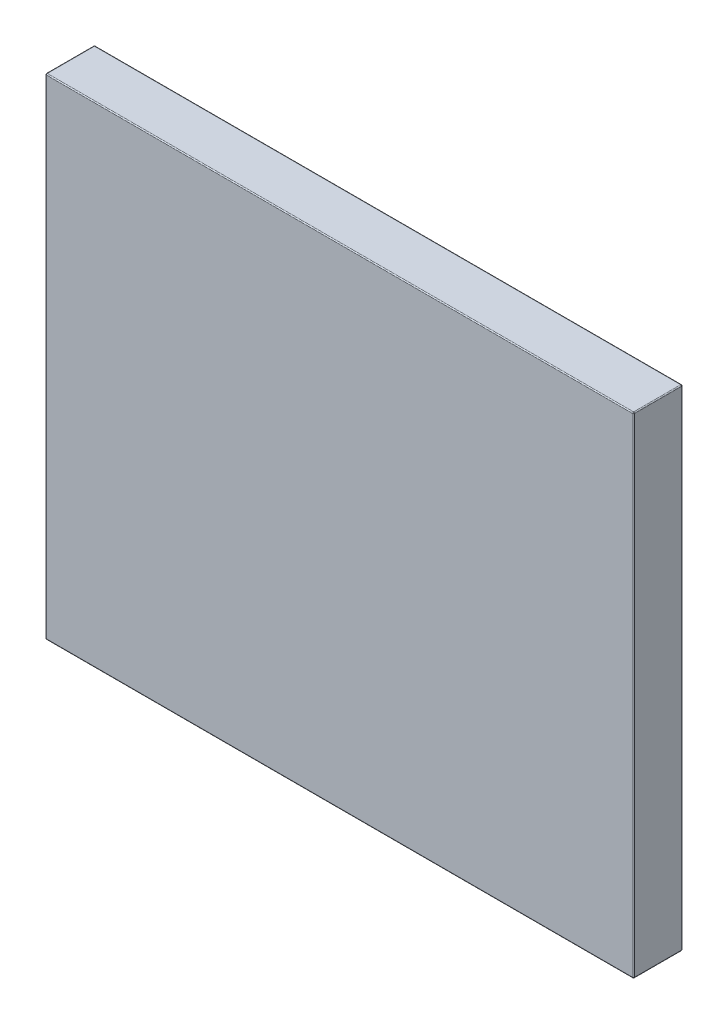
ISO-10303-21;
HEADER;
FILE_DESCRIPTION(('STEP AP214'),'2;1');
FILE_NAME('part.step','',(''),(''),'','','');
FILE_SCHEMA(('AUTOMOTIVE_DESIGN { 1 0 10303 214 1 1 1 1 }'));
ENDSEC;
DATA;
#1=APPLICATION_CONTEXT('core data for automotive mechanical design processes');
#2=APPLICATION_PROTOCOL_DEFINITION('international standard','automotive_design',2000,#1);
#3=PRODUCT_CONTEXT('',#1,'mechanical');
#4=PRODUCT('Part','Part','',(#3));
#5=PRODUCT_RELATED_PRODUCT_CATEGORY('part','',(#4));
#6=PRODUCT_DEFINITION_FORMATION('','',#4);
#7=PRODUCT_DEFINITION_CONTEXT('part definition',#1,'design');
#8=PRODUCT_DEFINITION('design','',#6,#7);
#9=PRODUCT_DEFINITION_SHAPE('','',#8);
#10=(LENGTH_UNIT() NAMED_UNIT(*) SI_UNIT(.MILLI.,.METRE.));
#11=(NAMED_UNIT(*) PLANE_ANGLE_UNIT() SI_UNIT($,.RADIAN.));
#12=(NAMED_UNIT(*) SI_UNIT($,.STERADIAN.) SOLID_ANGLE_UNIT());
#13=UNCERTAINTY_MEASURE_WITH_UNIT(LENGTH_MEASURE(1.E-05),#10,'distance_accuracy_value','');
#14=(GEOMETRIC_REPRESENTATION_CONTEXT(3) GLOBAL_UNCERTAINTY_ASSIGNED_CONTEXT((#13)) GLOBAL_UNIT_ASSIGNED_CONTEXT((#10,
#11,#12)) REPRESENTATION_CONTEXT('',''));
#15=CARTESIAN_POINT('',(0.,0.,0.));
#16=DIRECTION('',(0.,0.,1.));
#17=DIRECTION('',(1.,0.,0.));
#18=AXIS2_PLACEMENT_3D('',#15,#16,#17);
#19=CARTESIAN_POINT('',(0.299000000000127,-0.248999999999999,0.0490000000000004));
#20=DIRECTION('',(-0.816496580927742,-0.408248290463871,0.408248290463863));
#21=DIRECTION('',(0.577350269189626,-0.577350269189651,0.577350269189642));
#22=AXIS2_PLACEMENT_3D('',#19,#20,#21);
#23=SPHERICAL_SURFACE('',#22,0.001);
#24=CARTESIAN_POINT('',(0.299000000000127,-0.248999999999999,0.0490000000000004));
#25=DIRECTION('',(1.00000000000003,0.,0.));
#26=DIRECTION('',(0.,-1.00000000000003,0.));
#27=AXIS2_PLACEMENT_3D('',#24,#25,#26);
#28=CIRCLE('',#27,0.001);
#29=CARTESIAN_POINT('',(0.299000000000127,-0.248999999999999,0.0500000000000014));
#30=VERTEX_POINT('',#29);
#31=CARTESIAN_POINT('',(0.299000000000127,-0.25,0.0490000000000004));
#32=VERTEX_POINT('',#31);
#33=EDGE_CURVE('E11',#30,#32,#28,.T.);
#34=ORIENTED_EDGE('',*,*,#33,.T.);
#35=CARTESIAN_POINT('',(0.299000000000127,-0.248999999999999,0.0490000000000004));
#36=DIRECTION('',(0.,0.,1.));
#37=DIRECTION('',(1.00000000000003,0.,0.));
#38=AXIS2_PLACEMENT_3D('',#35,#36,#37);
#39=CIRCLE('',#38,0.001);
#40=CARTESIAN_POINT('',(0.300000000000128,-0.249000000000013,0.0490000000000004));
#41=VERTEX_POINT('',#40);
#42=EDGE_CURVE('E27',#32,#41,#39,.T.);
#43=ORIENTED_EDGE('',*,*,#42,.T.);
#44=CARTESIAN_POINT('',(0.299000000000127,-0.248999999999999,0.0490000000000004));
#45=DIRECTION('',(0.,-1.00000000000003,0.));
#46=DIRECTION('',(0.,0.,1.));
#47=AXIS2_PLACEMENT_3D('',#44,#45,#46);
#48=CIRCLE('',#47,0.001);
#49=EDGE_CURVE('E190',#41,#30,#48,.T.);
#50=ORIENTED_EDGE('',*,*,#49,.T.);
#51=EDGE_LOOP('',(#34,#43,#50));
#52=FACE_BOUND('',#51,.T.);
#53=ADVANCED_FACE('F16',(#52),#23,.T.);
#54=CARTESIAN_POINT('',(-0.298999999999872,-0.249000000001026,0.0490000000000004));
#55=DIRECTION('',(-0.816496580927742,0.408248290463875,-0.408248290463863));
#56=DIRECTION('',(-0.577350269189642,-0.577350269189642,0.577350269189626));
#57=AXIS2_PLACEMENT_3D('',#54,#55,#56);
#58=SPHERICAL_SURFACE('',#57,0.001);
#59=CARTESIAN_POINT('',(-0.298999999999872,-0.249000000001026,0.0490000000000004));
#60=DIRECTION('',(0.,-1.00000000000003,0.));
#61=DIRECTION('',(-1.00000000000003,0.,0.));
#62=AXIS2_PLACEMENT_3D('',#59,#60,#61);
#63=CIRCLE('',#62,0.001);
#64=CARTESIAN_POINT('',(-0.298999999999872,-0.249000000001026,0.0500000000000014));
#65=VERTEX_POINT('',#64);
#66=CARTESIAN_POINT('',(-0.299999999999872,-0.249000000002053,0.0490000000000004));
#67=VERTEX_POINT('',#66);
#68=EDGE_CURVE('E314',#65,#67,#63,.T.);
#69=ORIENTED_EDGE('',*,*,#68,.T.);
#70=CARTESIAN_POINT('',(-0.298999999999872,-0.249000000001026,0.0490000000000004));
#71=DIRECTION('',(0.,0.,1.));
#72=DIRECTION('',(0.,-1.00000000000003,0.));
#73=AXIS2_PLACEMENT_3D('',#70,#71,#72);
#74=CIRCLE('',#73,0.001);
#75=CARTESIAN_POINT('',(-0.298999999999872,-0.250000000001027,0.0490000000000004));
#76=VERTEX_POINT('',#75);
#77=EDGE_CURVE('E199',#67,#76,#74,.T.);
#78=ORIENTED_EDGE('',*,*,#77,.T.);
#79=CARTESIAN_POINT('',(-0.298999999999872,-0.249000000001026,0.0490000000000004));
#80=DIRECTION('',(-1.00000000000003,0.,0.));
#81=DIRECTION('',(0.,0.,1.));
#82=AXIS2_PLACEMENT_3D('',#79,#80,#81);
#83=CIRCLE('',#82,0.001);
#84=EDGE_CURVE('E195',#76,#65,#83,.T.);
#85=ORIENTED_EDGE('',*,*,#84,.T.);
#86=EDGE_LOOP('',(#69,#78,#85));
#87=FACE_BOUND('',#86,.T.);
#88=ADVANCED_FACE('F313',(#87),#58,.T.);
#89=CARTESIAN_POINT('',(0.299000000000127,-0.248999999999999,0.001000000000001));
#90=DIRECTION('',(-0.816496580927742,-0.408248290463867,-0.408248290463863));
#91=DIRECTION('',(0.577350269189626,-0.577350269189642,-0.57735026918961));
#92=AXIS2_PLACEMENT_3D('',#89,#90,#91);
#93=SPHERICAL_SURFACE('',#92,0.001);
#94=CARTESIAN_POINT('',(0.299000000000127,-0.248999999999999,0.001000000000001));
#95=DIRECTION('',(1.00000000000003,0.,0.));
#96=DIRECTION('',(0.,0.,-1.));
#97=AXIS2_PLACEMENT_3D('',#94,#95,#96);
#98=CIRCLE('',#97,0.001);
#99=CARTESIAN_POINT('',(0.299000000000126,-0.25,0.001000000000001));
#100=VERTEX_POINT('',#99);
#101=CARTESIAN_POINT('',(0.299000000000127,-0.248999999999999,0.));
#102=VERTEX_POINT('',#101);
#103=EDGE_CURVE('E200',#100,#102,#98,.T.);
#104=ORIENTED_EDGE('',*,*,#103,.T.);
#105=CARTESIAN_POINT('',(0.299000000000127,-0.248999999999999,0.001000000000001));
#106=DIRECTION('',(0.,-1.00000000000003,0.));
#107=DIRECTION('',(1.00000000000003,0.,0.));
#108=AXIS2_PLACEMENT_3D('',#105,#106,#107);
#109=CIRCLE('',#108,0.001);
#110=CARTESIAN_POINT('',(0.300000000000128,-0.249000000000013,0.001000000000001));
#111=VERTEX_POINT('',#110);
#112=EDGE_CURVE('E217',#102,#111,#109,.T.);
#113=ORIENTED_EDGE('',*,*,#112,.T.);
#114=CARTESIAN_POINT('',(0.299000000000127,-0.248999999999999,0.001000000000001));
#115=DIRECTION('',(0.,0.,-1.));
#116=DIRECTION('',(0.,-1.00000000000003,0.));
#117=AXIS2_PLACEMENT_3D('',#114,#115,#116);
#118=CIRCLE('',#117,0.001);
#119=EDGE_CURVE('E207',#111,#100,#118,.T.);
#120=ORIENTED_EDGE('',*,*,#119,.T.);
#121=EDGE_LOOP('',(#104,#113,#120));
#122=FACE_BOUND('',#121,.T.);
#123=ADVANCED_FACE('F341',(#122),#93,.T.);
#124=CARTESIAN_POINT('',(0.299000000000001,0.248999999999999,0.0490000000000004));
#125=DIRECTION('',(0.408248290463871,0.408248290463875,-0.816496580927726));
#126=DIRECTION('',(0.577350269189642,0.577350269189626,0.577350269189626));
#127=AXIS2_PLACEMENT_3D('',#124,#125,#126);
#128=SPHERICAL_SURFACE('',#127,0.001);
#129=CARTESIAN_POINT('',(0.299000000000001,0.248999999999999,0.0490000000000004));
#130=DIRECTION('',(0.,1.00000000000003,0.));
#131=DIRECTION('',(1.00000000000003,0.,0.));
#132=AXIS2_PLACEMENT_3D('',#129,#130,#131);
#133=CIRCLE('',#132,0.001);
#134=CARTESIAN_POINT('',(0.299000000000001,0.248999999999999,0.0500000000000014));
#135=VERTEX_POINT('',#134);
#136=CARTESIAN_POINT('',(0.3,0.248999999999999,0.0490000000000004));
#137=VERTEX_POINT('',#136);
#138=EDGE_CURVE('E205',#135,#137,#133,.T.);
#139=ORIENTED_EDGE('',*,*,#138,.T.);
#140=CARTESIAN_POINT('',(0.299000000000001,0.248999999999999,0.0490000000000004));
#141=DIRECTION('',(0.,0.,1.));
#142=DIRECTION('',(0.,1.00000000000003,0.));
#143=AXIS2_PLACEMENT_3D('',#140,#141,#142);
#144=CIRCLE('',#143,0.001);
#145=CARTESIAN_POINT('',(0.299000000000001,0.25,0.0490000000000004));
#146=VERTEX_POINT('',#145);
#147=EDGE_CURVE('E138',#137,#146,#144,.T.);
#148=ORIENTED_EDGE('',*,*,#147,.T.);
#149=CARTESIAN_POINT('',(0.299000000000001,0.248999999999999,0.0490000000000004));
#150=DIRECTION('',(1.00000000000003,0.,0.));
#151=DIRECTION('',(0.,0.,1.));
#152=AXIS2_PLACEMENT_3D('',#149,#150,#151);
#153=CIRCLE('',#152,0.001);
#154=EDGE_CURVE('E219',#146,#135,#153,.T.);
#155=ORIENTED_EDGE('',*,*,#154,.T.);
#156=EDGE_LOOP('',(#139,#148,#155));
#157=FACE_BOUND('',#156,.T.);
#158=ADVANCED_FACE('F362',(#157),#128,.T.);
#159=CARTESIAN_POINT('',(-0.299000000000127,0.248999999998972,0.0490000000000004));
#160=DIRECTION('',(-0.408248290463875,-0.816496580927742,0.408248290463863));
#161=DIRECTION('',(-0.577350269189626,0.577350269189642,0.57735026918961));
#162=AXIS2_PLACEMENT_3D('',#159,#160,#161);
#163=SPHERICAL_SURFACE('',#162,0.001);
#164=CARTESIAN_POINT('',(-0.299000000000127,0.248999999998972,0.0490000000000004));
#165=DIRECTION('',(-1.00000000000003,0.,0.));
#166=DIRECTION('',(0.,1.00000000000003,0.));
#167=AXIS2_PLACEMENT_3D('',#164,#165,#166);
#168=CIRCLE('',#167,0.001);
#169=CARTESIAN_POINT('',(-0.299000000000127,0.248999999998972,0.0500000000000014));
#170=VERTEX_POINT('',#169);
#171=CARTESIAN_POINT('',(-0.298999999999999,0.249999999998973,0.0490000000000004));
#172=VERTEX_POINT('',#171);
#173=EDGE_CURVE('E225',#170,#172,#168,.T.);
#174=ORIENTED_EDGE('',*,*,#173,.T.);
#175=CARTESIAN_POINT('',(-0.299000000000127,0.248999999998972,0.0490000000000004));
#176=DIRECTION('',(0.,0.,1.));
#177=DIRECTION('',(-1.00000000000003,0.,0.));
#178=AXIS2_PLACEMENT_3D('',#175,#176,#177);
#179=CIRCLE('',#178,0.001);
#180=CARTESIAN_POINT('',(-0.300000000000128,0.248999999997959,0.0490000000000004));
#181=VERTEX_POINT('',#180);
#182=EDGE_CURVE('E240',#172,#181,#179,.T.);
#183=ORIENTED_EDGE('',*,*,#182,.T.);
#184=CARTESIAN_POINT('',(-0.299000000000127,0.248999999998972,0.0490000000000004));
#185=DIRECTION('',(0.,1.00000000000003,0.));
#186=DIRECTION('',(0.,0.,1.));
#187=AXIS2_PLACEMENT_3D('',#184,#185,#186);
#188=CIRCLE('',#187,0.001);
#189=EDGE_CURVE('E244',#181,#170,#188,.T.);
#190=ORIENTED_EDGE('',*,*,#189,.T.);
#191=EDGE_LOOP('',(#174,#183,#190));
#192=FACE_BOUND('',#191,.T.);
#193=ADVANCED_FACE('F358',(#192),#163,.T.);
#194=CARTESIAN_POINT('',(-0.298999999999872,-0.249000000001026,0.001000000000001));
#195=DIRECTION('',(0.408248290463871,0.408248290463875,-0.816496580927726));
#196=DIRECTION('',(-0.577350269189642,-0.577350269189626,-0.577350269189626));
#197=AXIS2_PLACEMENT_3D('',#194,#195,#196);
#198=SPHERICAL_SURFACE('',#197,0.001);
#199=CARTESIAN_POINT('',(-0.298999999999872,-0.249000000001026,0.001000000000001));
#200=DIRECTION('',(0.,-1.00000000000003,0.));
#201=DIRECTION('',(0.,0.,-1.));
#202=AXIS2_PLACEMENT_3D('',#199,#200,#201);
#203=CIRCLE('',#202,0.001);
#204=CARTESIAN_POINT('',(-0.299999999999872,-0.249000000002053,0.001000000000001));
#205=VERTEX_POINT('',#204);
#206=CARTESIAN_POINT('',(-0.298999999999872,-0.249000000001026,0.));
#207=VERTEX_POINT('',#206);
#208=EDGE_CURVE('E253',#205,#207,#203,.T.);
#209=ORIENTED_EDGE('',*,*,#208,.T.);
#210=CARTESIAN_POINT('',(-0.298999999999872,-0.249000000001026,0.001000000000001));
#211=DIRECTION('',(-1.00000000000003,0.,0.));
#212=DIRECTION('',(0.,-1.00000000000003,0.));
#213=AXIS2_PLACEMENT_3D('',#210,#211,#212);
#214=CIRCLE('',#213,0.001);
#215=CARTESIAN_POINT('',(-0.298999999999872,-0.250000000001027,0.001000000000001));
#216=VERTEX_POINT('',#215);
#217=EDGE_CURVE('E256',#207,#216,#214,.T.);
#218=ORIENTED_EDGE('',*,*,#217,.T.);
#219=CARTESIAN_POINT('',(-0.298999999999872,-0.249000000001026,0.001000000000001));
#220=DIRECTION('',(0.,0.,-1.));
#221=DIRECTION('',(-1.00000000000003,0.,0.));
#222=AXIS2_PLACEMENT_3D('',#219,#220,#221);
#223=CIRCLE('',#222,0.001);
#224=EDGE_CURVE('E258',#216,#205,#223,.T.);
#225=ORIENTED_EDGE('',*,*,#224,.T.);
#226=EDGE_LOOP('',(#209,#218,#225));
#227=FACE_BOUND('',#226,.T.);
#228=ADVANCED_FACE('F361',(#227),#198,.T.);
#229=CARTESIAN_POINT('',(-0.149999999999872,-0.248999999999999,0.001000000000001));
#230=DIRECTION('',(-1.00000000000003,0.,0.));
#231=DIRECTION('',(0.,-0.707106781186564,-0.707106781186548));
#232=AXIS2_PLACEMENT_3D('',#229,#230,#231);
#233=CYLINDRICAL_SURFACE('',#232,0.001);
#234=ORIENTED_EDGE('',*,*,#217,.F.);
#235=DIRECTION('',(1.00000000000003,0.,0.));
#236=VECTOR('',#235,1.);
#237=CARTESIAN_POINT('',(-0.149999999999872,-0.248999999999999,0.));
#238=LINE('',#237,#236);
#239=EDGE_CURVE('E203',#207,#102,#238,.T.);
#240=ORIENTED_EDGE('',*,*,#239,.T.);
#241=ORIENTED_EDGE('',*,*,#103,.F.);
#242=DIRECTION('',(-1.00000000000003,0.,0.));
#243=VECTOR('',#242,1.);
#244=CARTESIAN_POINT('',(-0.149999999999872,-0.25,0.001000000000001));
#245=LINE('',#244,#243);
#246=EDGE_CURVE('E201',#100,#216,#245,.T.);
#247=ORIENTED_EDGE('',*,*,#246,.T.);
#248=EDGE_LOOP('',(#234,#240,#241,#247));
#249=FACE_BOUND('',#248,.T.);
#250=ADVANCED_FACE('F376',(#249),#233,.T.);
#251=CARTESIAN_POINT('',(-0.298999999999872,-0.249000000001026,0.));
#252=DIRECTION('',(0.,0.,1.));
#253=DIRECTION('',(-0.707106781186556,-0.707106781186564,0.));
#254=AXIS2_PLACEMENT_3D('',#251,#252,#253);
#255=CYLINDRICAL_SURFACE('',#254,0.001);
#256=ORIENTED_EDGE('',*,*,#77,.F.);
#257=DIRECTION('',(0.,0.,-1.));
#258=VECTOR('',#257,1.);
#259=CARTESIAN_POINT('',(-0.299999999999872,-0.249000000002053,0.));
#260=LINE('',#259,#258);
#261=EDGE_CURVE('E204',#67,#205,#260,.T.);
#262=ORIENTED_EDGE('',*,*,#261,.T.);
#263=ORIENTED_EDGE('',*,*,#224,.F.);
#264=DIRECTION('',(0.,0.,1.));
#265=VECTOR('',#264,1.);
#266=CARTESIAN_POINT('',(-0.298999999999872,-0.250000000001027,0.));
#267=LINE('',#266,#265);
#268=EDGE_CURVE('E166',#216,#76,#267,.T.);
#269=ORIENTED_EDGE('',*,*,#268,.T.);
#270=EDGE_LOOP('',(#256,#262,#263,#269));
#271=FACE_BOUND('',#270,.T.);
#272=ADVANCED_FACE('F304',(#271),#255,.T.);
#273=CARTESIAN_POINT('',(0.299000000000001,0.248999999999999,0.001000000000001));
#274=DIRECTION('',(-0.408248290463871,-0.408248290463867,-0.816496580927726));
#275=DIRECTION('',(0.577350269189642,0.577350269189642,-0.577350269189626));
#276=AXIS2_PLACEMENT_3D('',#273,#274,#275);
#277=SPHERICAL_SURFACE('',#276,0.001);
#278=CARTESIAN_POINT('',(0.299000000000001,0.248999999999999,0.001000000000001));
#279=DIRECTION('',(0.,1.00000000000003,0.));
#280=DIRECTION('',(0.,0.,-1.));
#281=AXIS2_PLACEMENT_3D('',#278,#279,#280);
#282=CIRCLE('',#281,0.001);
#283=CARTESIAN_POINT('',(0.3,0.248999999999999,0.001000000000001));
#284=VERTEX_POINT('',#283);
#285=CARTESIAN_POINT('',(0.299000000000001,0.248999999999999,0.));
#286=VERTEX_POINT('',#285);
#287=EDGE_CURVE('E150',#284,#286,#282,.T.);
#288=ORIENTED_EDGE('',*,*,#287,.T.);
#289=CARTESIAN_POINT('',(0.299000000000001,0.248999999999999,0.001000000000001));
#290=DIRECTION('',(1.00000000000003,0.,0.));
#291=DIRECTION('',(0.,1.00000000000003,0.));
#292=AXIS2_PLACEMENT_3D('',#289,#290,#291);
#293=CIRCLE('',#292,0.001);
#294=CARTESIAN_POINT('',(0.298999999999999,0.25,0.001000000000001));
#295=VERTEX_POINT('',#294);
#296=EDGE_CURVE('E153',#286,#295,#293,.T.);
#297=ORIENTED_EDGE('',*,*,#296,.T.);
#298=CARTESIAN_POINT('',(0.299000000000001,0.248999999999999,0.001000000000001));
#299=DIRECTION('',(0.,0.,-1.));
#300=DIRECTION('',(1.00000000000003,0.,0.));
#301=AXIS2_PLACEMENT_3D('',#298,#299,#300);
#302=CIRCLE('',#301,0.001);
#303=EDGE_CURVE('E135',#295,#284,#302,.T.);
#304=ORIENTED_EDGE('',*,*,#303,.T.);
#305=EDGE_LOOP('',(#288,#297,#304));
#306=FACE_BOUND('',#305,.T.);
#307=ADVANCED_FACE('F149',(#306),#277,.T.);
#308=CARTESIAN_POINT('',(-0.299000000000127,0.248999999998972,0.001000000000001));
#309=DIRECTION('',(-0.408248290463875,-0.816496580927759,-0.408248290463863));
#310=DIRECTION('',(-0.577350269189626,0.577350269189651,-0.577350269189642));
#311=AXIS2_PLACEMENT_3D('',#308,#309,#310);
#312=SPHERICAL_SURFACE('',#311,0.001);
#313=CARTESIAN_POINT('',(-0.299000000000127,0.248999999998972,0.001000000000001));
#314=DIRECTION('',(0.,0.,-1.));
#315=DIRECTION('',(0.,1.00000000000003,0.));
#316=AXIS2_PLACEMENT_3D('',#313,#314,#315);
#317=CIRCLE('',#316,0.001);
#318=CARTESIAN_POINT('',(-0.300000000000128,0.248999999997959,0.001000000000001));
#319=VERTEX_POINT('',#318);
#320=CARTESIAN_POINT('',(-0.298999999999999,0.249999999998973,0.001000000000001));
#321=VERTEX_POINT('',#320);
#322=EDGE_CURVE('E156',#319,#321,#317,.T.);
#323=ORIENTED_EDGE('',*,*,#322,.T.);
#324=CARTESIAN_POINT('',(-0.299000000000127,0.248999999998972,0.001000000000001));
#325=DIRECTION('',(-1.00000000000003,0.,0.));
#326=DIRECTION('',(0.,0.,-1.));
#327=AXIS2_PLACEMENT_3D('',#324,#325,#326);
#328=CIRCLE('',#327,0.001);
#329=CARTESIAN_POINT('',(-0.299000000000127,0.248999999998972,0.));
#330=VERTEX_POINT('',#329);
#331=EDGE_CURVE('E229',#321,#330,#328,.T.);
#332=ORIENTED_EDGE('',*,*,#331,.T.);
#333=CARTESIAN_POINT('',(-0.299000000000127,0.248999999998972,0.001000000000001));
#334=DIRECTION('',(0.,1.00000000000003,0.));
#335=DIRECTION('',(-1.00000000000003,0.,0.));
#336=AXIS2_PLACEMENT_3D('',#333,#334,#335);
#337=CIRCLE('',#336,0.001);
#338=EDGE_CURVE('E194',#330,#319,#337,.T.);
#339=ORIENTED_EDGE('',*,*,#338,.T.);
#340=EDGE_LOOP('',(#323,#332,#339));
#341=FACE_BOUND('',#340,.T.);
#342=ADVANCED_FACE('F351',(#341),#312,.T.);
#343=CARTESIAN_POINT('',(0.150000000000001,0.248999999997945,0.001000000000001));
#344=DIRECTION('',(1.00000000000003,0.,0.));
#345=DIRECTION('',(0.,0.707106781186564,-0.707106781186548));
#346=AXIS2_PLACEMENT_3D('',#343,#344,#345);
#347=CYLINDRICAL_SURFACE('',#346,0.001);
#348=ORIENTED_EDGE('',*,*,#296,.F.);
#349=DIRECTION('',(-1.00000000000003,0.,0.));
#350=VECTOR('',#349,1.);
#351=CARTESIAN_POINT('',(0.150000000000001,0.248999999997945,0.));
#352=LINE('',#351,#350);
#353=EDGE_CURVE('E191',#286,#330,#352,.T.);
#354=ORIENTED_EDGE('',*,*,#353,.T.);
#355=ORIENTED_EDGE('',*,*,#331,.F.);
#356=DIRECTION('',(1.00000000000003,0.,0.));
#357=VECTOR('',#356,1.);
#358=CARTESIAN_POINT('',(0.149999999999872,0.249999999997946,0.001000000000001));
#359=LINE('',#358,#357);
#360=EDGE_CURVE('E20',#321,#295,#359,.T.);
#361=ORIENTED_EDGE('',*,*,#360,.T.);
#362=EDGE_LOOP('',(#348,#354,#355,#361));
#363=FACE_BOUND('',#362,.T.);
#364=ADVANCED_FACE('F18',(#363),#347,.T.);
#365=CARTESIAN_POINT('',(-0.299000000000127,0.124999999998973,0.001000000000001));
#366=DIRECTION('',(0.,1.00000000000003,0.));
#367=DIRECTION('',(-0.707106781186564,0.,-0.707106781186548));
#368=AXIS2_PLACEMENT_3D('',#365,#366,#367);
#369=CYLINDRICAL_SURFACE('',#368,0.001);
#370=ORIENTED_EDGE('',*,*,#338,.F.);
#371=DIRECTION('',(0.,-1.00000000000003,0.));
#372=VECTOR('',#371,1.);
#373=CARTESIAN_POINT('',(-0.299000000000127,0.124999999998973,0.));
#374=LINE('',#373,#372);
#375=EDGE_CURVE('E248',#330,#207,#374,.T.);
#376=ORIENTED_EDGE('',*,*,#375,.T.);
#377=ORIENTED_EDGE('',*,*,#208,.F.);
#378=DIRECTION('',(0.,1.00000000000003,0.));
#379=VECTOR('',#378,1.);
#380=CARTESIAN_POINT('',(-0.300000000000128,0.124999999997946,0.001000000000001));
#381=LINE('',#380,#379);
#382=EDGE_CURVE('E251',#205,#319,#381,.T.);
#383=ORIENTED_EDGE('',*,*,#382,.T.);
#384=EDGE_LOOP('',(#370,#376,#377,#383));
#385=FACE_BOUND('',#384,.T.);
#386=ADVANCED_FACE('F366',(#385),#369,.T.);
#387=CARTESIAN_POINT('',(-0.299000000000127,0.248999999998972,0.));
#388=DIRECTION('',(0.,0.,1.));
#389=DIRECTION('',(-0.707106781186564,0.707106781186556,0.));
#390=AXIS2_PLACEMENT_3D('',#387,#388,#389);
#391=CYLINDRICAL_SURFACE('',#390,0.001);
#392=ORIENTED_EDGE('',*,*,#182,.F.);
#393=DIRECTION('',(0.,0.,-1.));
#394=VECTOR('',#393,1.);
#395=CARTESIAN_POINT('',(-0.298999999999999,0.249999999998973,0.));
#396=LINE('',#395,#394);
#397=EDGE_CURVE('E262',#172,#321,#396,.T.);
#398=ORIENTED_EDGE('',*,*,#397,.T.);
#399=ORIENTED_EDGE('',*,*,#322,.F.);
#400=DIRECTION('',(0.,0.,1.));
#401=VECTOR('',#400,1.);
#402=CARTESIAN_POINT('',(-0.300000000000128,0.248999999997959,0.));
#403=LINE('',#402,#401);
#404=EDGE_CURVE('E143',#319,#181,#403,.T.);
#405=ORIENTED_EDGE('',*,*,#404,.T.);
#406=EDGE_LOOP('',(#392,#398,#399,#405));
#407=FACE_BOUND('',#406,.T.);
#408=ADVANCED_FACE('F357',(#407),#391,.T.);
#409=CARTESIAN_POINT('',(0.299000000000001,0.248999999999999,0.));
#410=DIRECTION('',(0.,0.,1.));
#411=DIRECTION('',(0.707106781186556,0.707106781186564,0.));
#412=AXIS2_PLACEMENT_3D('',#409,#410,#411);
#413=CYLINDRICAL_SURFACE('',#412,0.001);
#414=ORIENTED_EDGE('',*,*,#147,.F.);
#415=DIRECTION('',(0.,0.,-1.));
#416=VECTOR('',#415,1.);
#417=CARTESIAN_POINT('',(0.3,0.248999999999999,0.));
#418=LINE('',#417,#416);
#419=EDGE_CURVE('E132',#137,#284,#418,.T.);
#420=ORIENTED_EDGE('',*,*,#419,.T.);
#421=ORIENTED_EDGE('',*,*,#303,.F.);
#422=DIRECTION('',(0.,0.,1.));
#423=VECTOR('',#422,1.);
#424=CARTESIAN_POINT('',(0.298999999999999,0.25,0.));
#425=LINE('',#424,#423);
#426=EDGE_CURVE('E144',#295,#146,#425,.T.);
#427=ORIENTED_EDGE('',*,*,#426,.T.);
#428=EDGE_LOOP('',(#414,#420,#421,#427));
#429=FACE_BOUND('',#428,.T.);
#430=ADVANCED_FACE('F134',(#429),#413,.T.);
#431=CARTESIAN_POINT('',(0.299000000000127,-0.125,0.001000000000001));
#432=DIRECTION('',(0.,-1.00000000000003,0.));
#433=DIRECTION('',(0.707106781186564,0.,-0.707106781186548));
#434=AXIS2_PLACEMENT_3D('',#431,#432,#433);
#435=CYLINDRICAL_SURFACE('',#434,0.001);
#436=ORIENTED_EDGE('',*,*,#112,.F.);
#437=DIRECTION('',(0.,1.00000000000003,0.));
#438=VECTOR('',#437,1.);
#439=CARTESIAN_POINT('',(0.299000000000127,-0.125,0.));
#440=LINE('',#439,#438);
#441=EDGE_CURVE('E164',#102,#286,#440,.T.);
#442=ORIENTED_EDGE('',*,*,#441,.T.);
#443=ORIENTED_EDGE('',*,*,#287,.F.);
#444=DIRECTION('',(0.,-1.00000000000003,0.));
#445=VECTOR('',#444,1.);
#446=CARTESIAN_POINT('',(0.300000000000128,-0.125,0.001000000000001));
#447=LINE('',#446,#445);
#448=EDGE_CURVE('E161',#284,#111,#447,.T.);
#449=ORIENTED_EDGE('',*,*,#448,.T.);
#450=EDGE_LOOP('',(#436,#442,#443,#449));
#451=FACE_BOUND('',#450,.T.);
#452=ADVANCED_FACE('F160',(#451),#435,.T.);
#453=CARTESIAN_POINT('',(-0.299000000000127,0.124999999998973,0.0490000000000004));
#454=DIRECTION('',(0.,-1.00000000000003,0.));
#455=DIRECTION('',(-0.707106781186564,0.,0.707106781186548));
#456=AXIS2_PLACEMENT_3D('',#453,#454,#455);
#457=CYLINDRICAL_SURFACE('',#456,0.001);
#458=ORIENTED_EDGE('',*,*,#68,.F.);
#459=DIRECTION('',(0.,1.00000000000003,0.));
#460=VECTOR('',#459,1.);
#461=CARTESIAN_POINT('',(-0.299000000000127,0.124999999998973,0.0500000000000014));
#462=LINE('',#461,#460);
#463=EDGE_CURVE('E173',#65,#170,#462,.T.);
#464=ORIENTED_EDGE('',*,*,#463,.T.);
#465=ORIENTED_EDGE('',*,*,#189,.F.);
#466=DIRECTION('',(0.,-1.00000000000003,0.));
#467=VECTOR('',#466,1.);
#468=CARTESIAN_POINT('',(-0.300000000000128,0.124999999997946,0.0490000000000004));
#469=LINE('',#468,#467);
#470=EDGE_CURVE('E181',#181,#67,#469,.T.);
#471=ORIENTED_EDGE('',*,*,#470,.T.);
#472=EDGE_LOOP('',(#458,#464,#465,#471));
#473=FACE_BOUND('',#472,.T.);
#474=ADVANCED_FACE('F345',(#473),#457,.T.);
#475=CARTESIAN_POINT('',(0.150000000000001,0.248999999997945,0.0490000000000004));
#476=DIRECTION('',(-1.00000000000003,0.,0.));
#477=DIRECTION('',(0.,0.707106781186564,0.707106781186548));
#478=AXIS2_PLACEMENT_3D('',#475,#476,#477);
#479=CYLINDRICAL_SURFACE('',#478,0.001);
#480=ORIENTED_EDGE('',*,*,#173,.F.);
#481=DIRECTION('',(1.00000000000003,0.,0.));
#482=VECTOR('',#481,1.);
#483=CARTESIAN_POINT('',(0.150000000000001,0.248999999997945,0.0500000000000014));
#484=LINE('',#483,#482);
#485=EDGE_CURVE('E273',#170,#135,#484,.T.);
#486=ORIENTED_EDGE('',*,*,#485,.T.);
#487=ORIENTED_EDGE('',*,*,#154,.F.);
#488=DIRECTION('',(-1.00000000000003,0.,0.));
#489=VECTOR('',#488,1.);
#490=CARTESIAN_POINT('',(0.150000000000001,0.249999999997946,0.0490000000000004));
#491=LINE('',#490,#489);
#492=EDGE_CURVE('E269',#146,#172,#491,.T.);
#493=ORIENTED_EDGE('',*,*,#492,.T.);
#494=EDGE_LOOP('',(#480,#486,#487,#493));
#495=FACE_BOUND('',#494,.T.);
#496=ADVANCED_FACE('F371',(#495),#479,.T.);
#497=CARTESIAN_POINT('',(0.299000000000127,-0.125,0.0490000000000004));
#498=DIRECTION('',(0.,1.00000000000003,0.));
#499=DIRECTION('',(0.707106781186564,0.,0.707106781186548));
#500=AXIS2_PLACEMENT_3D('',#497,#498,#499);
#501=CYLINDRICAL_SURFACE('',#500,0.001);
#502=ORIENTED_EDGE('',*,*,#138,.F.);
#503=DIRECTION('',(0.,-1.00000000000003,0.));
#504=VECTOR('',#503,1.);
#505=CARTESIAN_POINT('',(0.299000000000127,-0.125,0.0500000000000014));
#506=LINE('',#505,#504);
#507=EDGE_CURVE('E239',#135,#30,#506,.T.);
#508=ORIENTED_EDGE('',*,*,#507,.T.);
#509=ORIENTED_EDGE('',*,*,#49,.F.);
#510=DIRECTION('',(0.,1.00000000000003,0.));
#511=VECTOR('',#510,1.);
#512=CARTESIAN_POINT('',(0.300000000000128,-0.125,0.0490000000000004));
#513=LINE('',#512,#511);
#514=EDGE_CURVE('E236',#41,#137,#513,.T.);
#515=ORIENTED_EDGE('',*,*,#514,.T.);
#516=EDGE_LOOP('',(#502,#508,#509,#515));
#517=FACE_BOUND('',#516,.T.);
#518=ADVANCED_FACE('F368',(#517),#501,.T.);
#519=CARTESIAN_POINT('',(0.299000000000127,-0.248999999999999,0.));
#520=DIRECTION('',(0.,0.,1.));
#521=DIRECTION('',(0.707106781186564,-0.707106781186556,0.));
#522=AXIS2_PLACEMENT_3D('',#519,#520,#521);
#523=CYLINDRICAL_SURFACE('',#522,0.001);
#524=ORIENTED_EDGE('',*,*,#42,.F.);
#525=DIRECTION('',(0.,0.,-1.));
#526=VECTOR('',#525,1.);
#527=CARTESIAN_POINT('',(0.299000000000126,-0.25,0.));
#528=LINE('',#527,#526);
#529=EDGE_CURVE('E41',#32,#100,#528,.T.);
#530=ORIENTED_EDGE('',*,*,#529,.T.);
#531=ORIENTED_EDGE('',*,*,#119,.F.);
#532=DIRECTION('',(0.,0.,1.));
#533=VECTOR('',#532,1.);
#534=CARTESIAN_POINT('',(0.300000000000128,-0.249000000000013,0.));
#535=LINE('',#534,#533);
#536=EDGE_CURVE('E171',#111,#41,#535,.T.);
#537=ORIENTED_EDGE('',*,*,#536,.T.);
#538=EDGE_LOOP('',(#524,#530,#531,#537));
#539=FACE_BOUND('',#538,.T.);
#540=ADVANCED_FACE('F330',(#539),#523,.T.);
#541=CARTESIAN_POINT('',(-0.149999999999872,-0.248999999999999,0.0490000000000004));
#542=DIRECTION('',(1.00000000000003,0.,0.));
#543=DIRECTION('',(0.,-0.707106781186564,0.707106781186548));
#544=AXIS2_PLACEMENT_3D('',#541,#542,#543);
#545=CYLINDRICAL_SURFACE('',#544,0.001);
#546=ORIENTED_EDGE('',*,*,#33,.F.);
#547=DIRECTION('',(-1.00000000000003,0.,0.));
#548=VECTOR('',#547,1.);
#549=CARTESIAN_POINT('',(-0.149999999999872,-0.248999999999999,0.0500000000000014));
#550=LINE('',#549,#548);
#551=EDGE_CURVE('E278',#30,#65,#550,.T.);
#552=ORIENTED_EDGE('',*,*,#551,.T.);
#553=ORIENTED_EDGE('',*,*,#84,.F.);
#554=DIRECTION('',(1.00000000000003,0.,0.));
#555=VECTOR('',#554,1.);
#556=CARTESIAN_POINT('',(-0.149999999999872,-0.25,0.0490000000000004));
#557=LINE('',#556,#555);
#558=EDGE_CURVE('E274',#76,#32,#557,.T.);
#559=ORIENTED_EDGE('',*,*,#558,.T.);
#560=EDGE_LOOP('',(#546,#552,#553,#559));
#561=FACE_BOUND('',#560,.T.);
#562=ADVANCED_FACE('F309',(#561),#545,.T.);
#563=CARTESIAN_POINT('',(-0.299999999999873,-0.250000000002054,0.));
#564=DIRECTION('',(0.,-1.00000000000003,0.));
#565=DIRECTION('',(0.,0.,-1.));
#566=AXIS2_PLACEMENT_3D('',#563,#564,#565);
#567=PLANE('',#566);
#568=ORIENTED_EDGE('',*,*,#246,.F.);
#569=ORIENTED_EDGE('',*,*,#529,.F.);
#570=ORIENTED_EDGE('',*,*,#558,.F.);
#571=ORIENTED_EDGE('',*,*,#268,.F.);
#572=EDGE_LOOP('',(#568,#569,#570,#571));
#573=FACE_BOUND('',#572,.T.);
#574=ADVANCED_FACE('F317',(#573),#567,.T.);
#575=CARTESIAN_POINT('',(-0.3,0.249999999997946,0.));
#576=DIRECTION('',(-1.00000000000003,0.,0.));
#577=DIRECTION('',(0.,0.,1.));
#578=AXIS2_PLACEMENT_3D('',#575,#576,#577);
#579=PLANE('',#578);
#580=ORIENTED_EDGE('',*,*,#261,.F.);
#581=ORIENTED_EDGE('',*,*,#470,.F.);
#582=ORIENTED_EDGE('',*,*,#404,.F.);
#583=ORIENTED_EDGE('',*,*,#382,.F.);
#584=EDGE_LOOP('',(#580,#581,#582,#583));
#585=FACE_BOUND('',#584,.T.);
#586=ADVANCED_FACE('F319',(#585),#579,.T.);
#587=CARTESIAN_POINT('',(0.3,0.25,0.));
#588=DIRECTION('',(0.,1.00000000000003,0.));
#589=DIRECTION('',(1.00000000000003,0.,0.));
#590=AXIS2_PLACEMENT_3D('',#587,#588,#589);
#591=PLANE('',#590);
#592=ORIENTED_EDGE('',*,*,#360,.F.);
#593=ORIENTED_EDGE('',*,*,#397,.F.);
#594=ORIENTED_EDGE('',*,*,#492,.F.);
#595=ORIENTED_EDGE('',*,*,#426,.F.);
#596=EDGE_LOOP('',(#592,#593,#594,#595));
#597=FACE_BOUND('',#596,.T.);
#598=ADVANCED_FACE('F327',(#597),#591,.T.);
#599=CARTESIAN_POINT('',(0.,0.,0.));
#600=DIRECTION('',(0.,0.,1.));
#601=DIRECTION('',(1.00000000000003,0.,0.));
#602=AXIS2_PLACEMENT_3D('',#599,#600,#601);
#603=PLANE('',#602);
#604=ORIENTED_EDGE('',*,*,#353,.F.);
#605=ORIENTED_EDGE('',*,*,#441,.F.);
#606=ORIENTED_EDGE('',*,*,#239,.F.);
#607=ORIENTED_EDGE('',*,*,#375,.F.);
#608=EDGE_LOOP('',(#604,#605,#606,#607));
#609=FACE_BOUND('',#608,.T.);
#610=ADVANCED_FACE('F347',(#609),#603,.F.);
#611=CARTESIAN_POINT('',(0.300000000000127,-0.25,0.));
#612=DIRECTION('',(1.00000000000003,0.,0.));
#613=DIRECTION('',(0.,1.00000000000003,0.));
#614=AXIS2_PLACEMENT_3D('',#611,#612,#613);
#615=PLANE('',#614);
#616=ORIENTED_EDGE('',*,*,#419,.F.);
#617=ORIENTED_EDGE('',*,*,#514,.F.);
#618=ORIENTED_EDGE('',*,*,#536,.F.);
#619=ORIENTED_EDGE('',*,*,#448,.F.);
#620=EDGE_LOOP('',(#616,#617,#618,#619));
#621=FACE_BOUND('',#620,.T.);
#622=ADVANCED_FACE('F169',(#621),#615,.T.);
#623=CARTESIAN_POINT('',(0.,0.,0.0500000000000014));
#624=DIRECTION('',(0.,0.,1.));
#625=DIRECTION('',(1.00000000000003,0.,0.));
#626=AXIS2_PLACEMENT_3D('',#623,#624,#625);
#627=PLANE('',#626);
#628=ORIENTED_EDGE('',*,*,#463,.F.);
#629=ORIENTED_EDGE('',*,*,#551,.F.);
#630=ORIENTED_EDGE('',*,*,#507,.F.);
#631=ORIENTED_EDGE('',*,*,#485,.F.);
#632=EDGE_LOOP('',(#628,#629,#630,#631));
#633=FACE_BOUND('',#632,.T.);
#634=ADVANCED_FACE('F491',(#633),#627,.T.);
#635=CLOSED_SHELL('',(#53,#88,#123,#158,#193,#228,#250,#272,#307,#342,#364,#386,#408,#430,#452,
#474,#496,#518,#540,#562,#574,#586,#598,#610,#622,#634));
#636=MANIFOLD_SOLID_BREP('B1',#635);
#637=ADVANCED_BREP_SHAPE_REPRESENTATION('',(#18,#636),#14);
#638=SHAPE_DEFINITION_REPRESENTATION(#9,#637);
ENDSEC;
END-ISO-10303-21;
